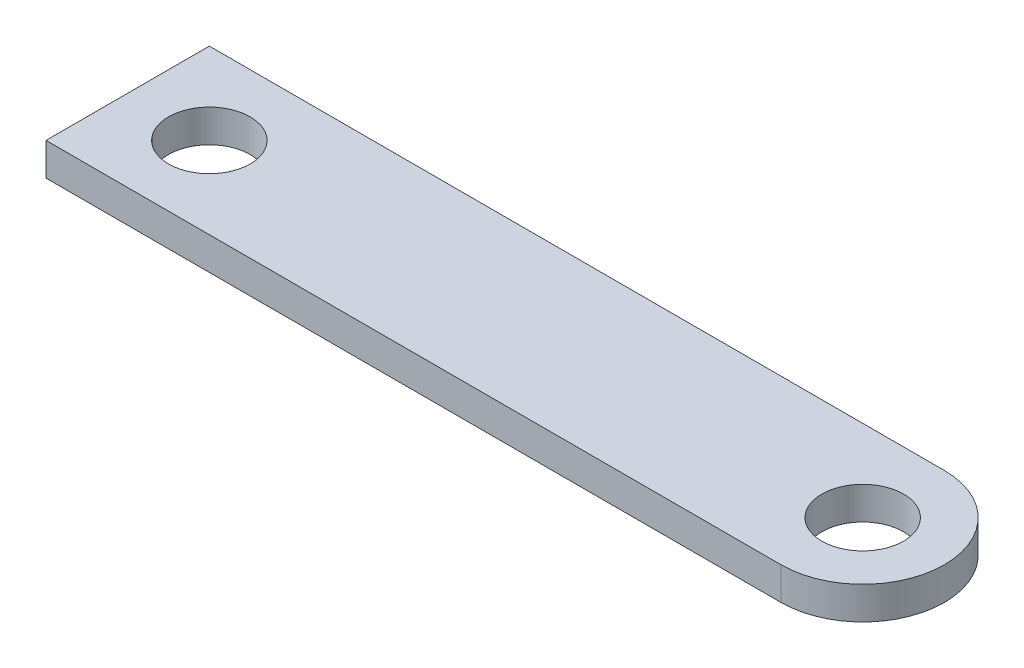
ISO-10303-21;
HEADER;
FILE_DESCRIPTION(('STEP AP214'),'2;1');
FILE_NAME('part.step','',(''),(''),'','','');
FILE_SCHEMA(('AUTOMOTIVE_DESIGN { 1 0 10303 214 1 1 1 1 }'));
ENDSEC;
DATA;
#1=APPLICATION_CONTEXT('core data for automotive mechanical design processes');
#2=APPLICATION_PROTOCOL_DEFINITION('international standard','automotive_design',2000,#1);
#3=PRODUCT_CONTEXT('',#1,'mechanical');
#4=PRODUCT('Part','Part','',(#3));
#5=PRODUCT_RELATED_PRODUCT_CATEGORY('part','',(#4));
#6=PRODUCT_DEFINITION_FORMATION('','',#4);
#7=PRODUCT_DEFINITION_CONTEXT('part definition',#1,'design');
#8=PRODUCT_DEFINITION('design','',#6,#7);
#9=PRODUCT_DEFINITION_SHAPE('','',#8);
#10=(LENGTH_UNIT() NAMED_UNIT(*) SI_UNIT(.MILLI.,.METRE.));
#11=(NAMED_UNIT(*) PLANE_ANGLE_UNIT() SI_UNIT($,.RADIAN.));
#12=(NAMED_UNIT(*) SI_UNIT($,.STERADIAN.) SOLID_ANGLE_UNIT());
#13=UNCERTAINTY_MEASURE_WITH_UNIT(LENGTH_MEASURE(1.E-05),#10,'distance_accuracy_value','');
#14=(GEOMETRIC_REPRESENTATION_CONTEXT(3) GLOBAL_UNCERTAINTY_ASSIGNED_CONTEXT((#13)) GLOBAL_UNIT_ASSIGNED_CONTEXT((#10,
#11,#12)) REPRESENTATION_CONTEXT('',''));
#15=CARTESIAN_POINT('',(0.,0.,0.));
#16=DIRECTION('',(0.,0.,1.));
#17=DIRECTION('',(1.,0.,0.));
#18=AXIS2_PLACEMENT_3D('',#15,#16,#17);
#19=CARTESIAN_POINT('',(22.5,2.,0.));
#20=DIRECTION('',(0.,-1.,0.));
#21=DIRECTION('',(0.,0.,-1.));
#22=AXIS2_PLACEMENT_3D('',#19,#20,#21);
#23=CYLINDRICAL_SURFACE('',#22,5.);
#24=CARTESIAN_POINT('',(22.5,0.,0.));
#25=DIRECTION('',(0.,1.,0.));
#26=DIRECTION('',(0.,0.,1.));
#27=AXIS2_PLACEMENT_3D('',#24,#25,#26);
#28=CIRCLE('',#27,5.);
#29=CARTESIAN_POINT('',(22.5,0.,5.));
#30=VERTEX_POINT('',#29);
#31=CARTESIAN_POINT('',(22.5,0.,-5.));
#32=VERTEX_POINT('',#31);
#33=EDGE_CURVE('E121',#30,#32,#28,.T.);
#34=ORIENTED_EDGE('',*,*,#33,.T.);
#35=DIRECTION('',(0.,-1.,0.));
#36=VECTOR('',#35,1.);
#37=CARTESIAN_POINT('',(22.5,2.,-5.));
#38=LINE('',#37,#36);
#39=CARTESIAN_POINT('',(22.5,2.,-5.));
#40=VERTEX_POINT('',#39);
#41=EDGE_CURVE('E11',#40,#32,#38,.T.);
#42=ORIENTED_EDGE('',*,*,#41,.F.);
#43=CARTESIAN_POINT('',(22.5,2.,0.));
#44=DIRECTION('',(0.,1.,0.));
#45=DIRECTION('',(0.,0.,1.));
#46=AXIS2_PLACEMENT_3D('',#43,#44,#45);
#47=CIRCLE('',#46,5.);
#48=CARTESIAN_POINT('',(22.5,2.,5.));
#49=VERTEX_POINT('',#48);
#50=EDGE_CURVE('E85',#49,#40,#47,.T.);
#51=ORIENTED_EDGE('',*,*,#50,.F.);
#52=DIRECTION('',(0.,-1.,0.));
#53=VECTOR('',#52,1.);
#54=CARTESIAN_POINT('',(22.5,2.,5.));
#55=LINE('',#54,#53);
#56=EDGE_CURVE('E120',#49,#30,#55,.T.);
#57=ORIENTED_EDGE('',*,*,#56,.T.);
#58=EDGE_LOOP('',(#34,#42,#51,#57));
#59=FACE_BOUND('',#58,.T.);
#60=ADVANCED_FACE('F45',(#59),#23,.T.);
#61=CARTESIAN_POINT('',(0.,2.,-5.));
#62=DIRECTION('',(0.,0.,-1.));
#63=DIRECTION('',(-1.,0.,0.));
#64=AXIS2_PLACEMENT_3D('',#61,#62,#63);
#65=PLANE('',#64);
#66=DIRECTION('',(1.,0.,0.));
#67=VECTOR('',#66,1.);
#68=CARTESIAN_POINT('',(0.,0.,-5.));
#69=LINE('',#68,#67);
#70=CARTESIAN_POINT('',(-22.5,0.,-5.));
#71=VERTEX_POINT('',#70);
#72=EDGE_CURVE('E94',#71,#32,#69,.T.);
#73=ORIENTED_EDGE('',*,*,#72,.F.);
#74=DIRECTION('',(0.,-1.,0.));
#75=VECTOR('',#74,1.);
#76=CARTESIAN_POINT('',(-22.5,2.,-5.));
#77=LINE('',#76,#75);
#78=CARTESIAN_POINT('',(-22.5,2.,-5.));
#79=VERTEX_POINT('',#78);
#80=EDGE_CURVE('E54',#79,#71,#77,.T.);
#81=ORIENTED_EDGE('',*,*,#80,.F.);
#82=DIRECTION('',(1.,0.,0.));
#83=VECTOR('',#82,1.);
#84=CARTESIAN_POINT('',(0.,2.,-5.));
#85=LINE('',#84,#83);
#86=EDGE_CURVE('E92',#79,#40,#85,.T.);
#87=ORIENTED_EDGE('',*,*,#86,.T.);
#88=ORIENTED_EDGE('',*,*,#41,.T.);
#89=EDGE_LOOP('',(#73,#81,#87,#88));
#90=FACE_BOUND('',#89,.T.);
#91=ADVANCED_FACE('F91',(#90),#65,.T.);
#92=CARTESIAN_POINT('',(-22.5,2.,0.));
#93=DIRECTION('',(-1.,0.,0.));
#94=DIRECTION('',(0.,0.,1.));
#95=AXIS2_PLACEMENT_3D('',#92,#93,#94);
#96=PLANE('',#95);
#97=DIRECTION('',(0.,0.,-1.));
#98=VECTOR('',#97,1.);
#99=CARTESIAN_POINT('',(-22.5,0.,0.));
#100=LINE('',#99,#98);
#101=CARTESIAN_POINT('',(-22.5,0.,5.));
#102=VERTEX_POINT('',#101);
#103=EDGE_CURVE('E127',#102,#71,#100,.T.);
#104=ORIENTED_EDGE('',*,*,#103,.F.);
#105=DIRECTION('',(0.,-1.,0.));
#106=VECTOR('',#105,1.);
#107=CARTESIAN_POINT('',(-22.5,2.,5.));
#108=LINE('',#107,#106);
#109=CARTESIAN_POINT('',(-22.5,2.,5.));
#110=VERTEX_POINT('',#109);
#111=EDGE_CURVE('E77',#110,#102,#108,.T.);
#112=ORIENTED_EDGE('',*,*,#111,.F.);
#113=DIRECTION('',(0.,0.,-1.));
#114=VECTOR('',#113,1.);
#115=CARTESIAN_POINT('',(-22.5,2.,0.));
#116=LINE('',#115,#114);
#117=EDGE_CURVE('E102',#110,#79,#116,.T.);
#118=ORIENTED_EDGE('',*,*,#117,.T.);
#119=ORIENTED_EDGE('',*,*,#80,.T.);
#120=EDGE_LOOP('',(#104,#112,#118,#119));
#121=FACE_BOUND('',#120,.T.);
#122=ADVANCED_FACE('F105',(#121),#96,.T.);
#123=CARTESIAN_POINT('',(-17.5,2.,0.));
#124=DIRECTION('',(0.,-1.,0.));
#125=DIRECTION('',(0.,0.,-1.));
#126=AXIS2_PLACEMENT_3D('',#123,#124,#125);
#127=CYLINDRICAL_SURFACE('',#126,2.5);
#128=CARTESIAN_POINT('',(-17.5,2.,0.));
#129=DIRECTION('',(0.,1.,0.));
#130=DIRECTION('',(0.,0.,1.));
#131=AXIS2_PLACEMENT_3D('',#128,#129,#130);
#132=CIRCLE('',#131,2.5);
#133=CARTESIAN_POINT('',(-17.5,2.,2.5));
#134=VERTEX_POINT('',#133);
#135=EDGE_CURVE('E109',#134,#134,#132,.T.);
#136=ORIENTED_EDGE('',*,*,#135,.T.);
#137=EDGE_LOOP('',(#136));
#138=FACE_BOUND('',#137,.T.);
#139=CARTESIAN_POINT('',(-17.5,0.,0.));
#140=DIRECTION('',(0.,1.,0.));
#141=DIRECTION('',(0.,0.,1.));
#142=AXIS2_PLACEMENT_3D('',#139,#140,#141);
#143=CIRCLE('',#142,2.5);
#144=CARTESIAN_POINT('',(-17.5,0.,2.5));
#145=VERTEX_POINT('',#144);
#146=EDGE_CURVE('E132',#145,#145,#143,.T.);
#147=ORIENTED_EDGE('',*,*,#146,.F.);
#148=EDGE_LOOP('',(#147));
#149=FACE_BOUND('',#148,.T.);
#150=ADVANCED_FACE('F164',(#138,#149),#127,.F.);
#151=CARTESIAN_POINT('',(0.,2.,5.));
#152=DIRECTION('',(0.,0.,-1.));
#153=DIRECTION('',(-1.,0.,0.));
#154=AXIS2_PLACEMENT_3D('',#151,#152,#153);
#155=PLANE('',#154);
#156=DIRECTION('',(1.,0.,0.));
#157=VECTOR('',#156,1.);
#158=CARTESIAN_POINT('',(0.,0.,5.));
#159=LINE('',#158,#157);
#160=EDGE_CURVE('E80',#102,#30,#159,.T.);
#161=ORIENTED_EDGE('',*,*,#160,.T.);
#162=ORIENTED_EDGE('',*,*,#56,.F.);
#163=DIRECTION('',(1.,0.,0.));
#164=VECTOR('',#163,1.);
#165=CARTESIAN_POINT('',(0.,2.,5.));
#166=LINE('',#165,#164);
#167=EDGE_CURVE('E62',#110,#49,#166,.T.);
#168=ORIENTED_EDGE('',*,*,#167,.F.);
#169=ORIENTED_EDGE('',*,*,#111,.T.);
#170=EDGE_LOOP('',(#161,#162,#168,#169));
#171=FACE_BOUND('',#170,.T.);
#172=ADVANCED_FACE('F156',(#171),#155,.F.);
#173=CARTESIAN_POINT('',(22.5,2.,0.));
#174=DIRECTION('',(0.,-1.,0.));
#175=DIRECTION('',(0.,0.,-1.));
#176=AXIS2_PLACEMENT_3D('',#173,#174,#175);
#177=CYLINDRICAL_SURFACE('',#176,2.5);
#178=CARTESIAN_POINT('',(22.5,2.,0.));
#179=DIRECTION('',(0.,1.,0.));
#180=DIRECTION('',(0.,0.,1.));
#181=AXIS2_PLACEMENT_3D('',#178,#179,#180);
#182=CIRCLE('',#181,2.5);
#183=CARTESIAN_POINT('',(22.5,2.,2.5));
#184=VERTEX_POINT('',#183);
#185=EDGE_CURVE('E116',#184,#184,#182,.T.);
#186=ORIENTED_EDGE('',*,*,#185,.T.);
#187=EDGE_LOOP('',(#186));
#188=FACE_BOUND('',#187,.T.);
#189=CARTESIAN_POINT('',(22.5,0.,0.));
#190=DIRECTION('',(0.,1.,0.));
#191=DIRECTION('',(0.,0.,1.));
#192=AXIS2_PLACEMENT_3D('',#189,#190,#191);
#193=CIRCLE('',#192,2.5);
#194=CARTESIAN_POINT('',(22.5,0.,2.5));
#195=VERTEX_POINT('',#194);
#196=EDGE_CURVE('E136',#195,#195,#193,.T.);
#197=ORIENTED_EDGE('',*,*,#196,.F.);
#198=EDGE_LOOP('',(#197));
#199=FACE_BOUND('',#198,.T.);
#200=ADVANCED_FACE('F154',(#188,#199),#177,.F.);
#201=CARTESIAN_POINT('',(0.,2.,0.));
#202=DIRECTION('',(0.,1.,0.));
#203=DIRECTION('',(0.,0.,1.));
#204=AXIS2_PLACEMENT_3D('',#201,#202,#203);
#205=PLANE('',#204);
#206=ORIENTED_EDGE('',*,*,#50,.T.);
#207=ORIENTED_EDGE('',*,*,#86,.F.);
#208=ORIENTED_EDGE('',*,*,#117,.F.);
#209=ORIENTED_EDGE('',*,*,#167,.T.);
#210=EDGE_LOOP('',(#206,#207,#208,#209));
#211=FACE_BOUND('',#210,.T.);
#212=ORIENTED_EDGE('',*,*,#135,.F.);
#213=EDGE_LOOP('',(#212));
#214=FACE_BOUND('',#213,.T.);
#215=ORIENTED_EDGE('',*,*,#185,.F.);
#216=EDGE_LOOP('',(#215));
#217=FACE_BOUND('',#216,.T.);
#218=ADVANCED_FACE('F100',(#211,#214,#217),#205,.T.);
#219=CARTESIAN_POINT('',(0.,0.,0.));
#220=DIRECTION('',(0.,1.,0.));
#221=DIRECTION('',(0.,0.,1.));
#222=AXIS2_PLACEMENT_3D('',#219,#220,#221);
#223=PLANE('',#222);
#224=ORIENTED_EDGE('',*,*,#33,.F.);
#225=ORIENTED_EDGE('',*,*,#160,.F.);
#226=ORIENTED_EDGE('',*,*,#103,.T.);
#227=ORIENTED_EDGE('',*,*,#72,.T.);
#228=EDGE_LOOP('',(#224,#225,#226,#227));
#229=FACE_BOUND('',#228,.T.);
#230=ORIENTED_EDGE('',*,*,#146,.T.);
#231=EDGE_LOOP('',(#230));
#232=FACE_BOUND('',#231,.T.);
#233=ORIENTED_EDGE('',*,*,#196,.T.);
#234=EDGE_LOOP('',(#233));
#235=FACE_BOUND('',#234,.T.);
#236=ADVANCED_FACE('F146',(#229,#232,#235),#223,.F.);
#237=CLOSED_SHELL('',(#60,#91,#122,#150,#172,#200,#218,#236));
#238=MANIFOLD_SOLID_BREP('B2',#237);
#239=ADVANCED_BREP_SHAPE_REPRESENTATION('',(#18,#238),#14);
#240=SHAPE_DEFINITION_REPRESENTATION(#9,#239);
ENDSEC;
END-ISO-10303-21;
